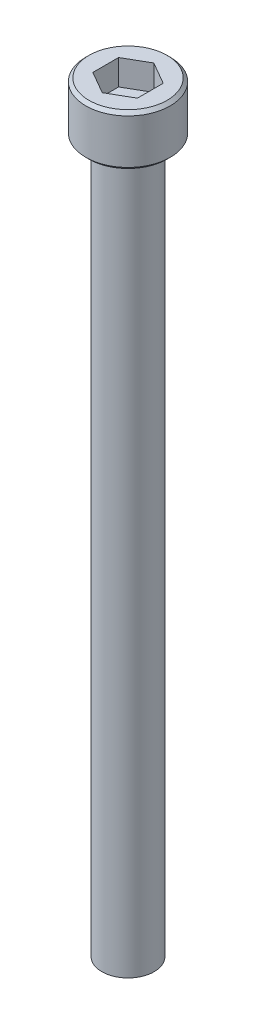
ISO-10303-21;
HEADER;
FILE_DESCRIPTION(('STEP AP214'),'2;1');
FILE_NAME('part.step','',(''),(''),'','','');
FILE_SCHEMA(('AUTOMOTIVE_DESIGN { 1 0 10303 214 1 1 1 1 }'));
ENDSEC;
DATA;
#1=APPLICATION_CONTEXT('core data for automotive mechanical design processes');
#2=APPLICATION_PROTOCOL_DEFINITION('international standard','automotive_design',2000,#1);
#3=PRODUCT_CONTEXT('',#1,'mechanical');
#4=PRODUCT('Part','Part','',(#3));
#5=PRODUCT_RELATED_PRODUCT_CATEGORY('part','',(#4));
#6=PRODUCT_DEFINITION_FORMATION('','',#4);
#7=PRODUCT_DEFINITION_CONTEXT('part definition',#1,'design');
#8=PRODUCT_DEFINITION('design','',#6,#7);
#9=PRODUCT_DEFINITION_SHAPE('','',#8);
#10=(LENGTH_UNIT() NAMED_UNIT(*) SI_UNIT(.MILLI.,.METRE.));
#11=(NAMED_UNIT(*) PLANE_ANGLE_UNIT() SI_UNIT($,.RADIAN.));
#12=(NAMED_UNIT(*) SI_UNIT($,.STERADIAN.) SOLID_ANGLE_UNIT());
#13=UNCERTAINTY_MEASURE_WITH_UNIT(LENGTH_MEASURE(1.E-05),#10,'distance_accuracy_value','');
#14=(GEOMETRIC_REPRESENTATION_CONTEXT(3) GLOBAL_UNCERTAINTY_ASSIGNED_CONTEXT((#13)) GLOBAL_UNIT_ASSIGNED_CONTEXT((#10,
#11,#12)) REPRESENTATION_CONTEXT('',''));
#15=CARTESIAN_POINT('',(0.,0.,0.));
#16=DIRECTION('',(0.,0.,1.));
#17=DIRECTION('',(1.,0.,0.));
#18=AXIS2_PLACEMENT_3D('',#15,#16,#17);
#19=CARTESIAN_POINT('',(1.778,2.032,3.07958633585746));
#20=DIRECTION('',(0.,1.,0.));
#21=DIRECTION('',(0.,0.,1.));
#22=AXIS2_PLACEMENT_3D('',#19,#20,#21);
#23=PLANE('',#22);
#24=DIRECTION('',(-0.866025403784439,0.,0.5));
#25=VECTOR('',#24,1.);
#26=CARTESIAN_POINT('',(0.,2.032,-2.05305755723831));
#27=LINE('',#26,#25);
#28=CARTESIAN_POINT('',(0.,2.032,-2.05305755723831));
#29=VERTEX_POINT('',#28);
#30=CARTESIAN_POINT('',(-1.778,2.032,-1.02652877861915));
#31=VERTEX_POINT('',#30);
#32=EDGE_CURVE('E68',#29,#31,#27,.T.);
#33=ORIENTED_EDGE('',*,*,#32,.T.);
#34=DIRECTION('',(0.,0.,1.));
#35=VECTOR('',#34,1.);
#36=CARTESIAN_POINT('',(-1.778,2.032,-1.02652877861915));
#37=LINE('',#36,#35);
#38=CARTESIAN_POINT('',(-1.778,2.032,1.02652877861915));
#39=VERTEX_POINT('',#38);
#40=EDGE_CURVE('E70',#31,#39,#37,.T.);
#41=ORIENTED_EDGE('',*,*,#40,.T.);
#42=DIRECTION('',(0.866025403784439,0.,0.499999999999999));
#43=VECTOR('',#42,1.);
#44=CARTESIAN_POINT('',(-1.778,2.032,1.02652877861915));
#45=LINE('',#44,#43);
#46=CARTESIAN_POINT('',(0.,2.032,2.05305755723831));
#47=VERTEX_POINT('',#46);
#48=EDGE_CURVE('E72',#39,#47,#45,.T.);
#49=ORIENTED_EDGE('',*,*,#48,.T.);
#50=DIRECTION('',(0.866025403784439,0.,-0.5));
#51=VECTOR('',#50,1.);
#52=CARTESIAN_POINT('',(0.,2.032,2.05305755723831));
#53=LINE('',#52,#51);
#54=CARTESIAN_POINT('',(1.778,2.032,1.02652877861915));
#55=VERTEX_POINT('',#54);
#56=EDGE_CURVE('E127',#47,#55,#53,.T.);
#57=ORIENTED_EDGE('',*,*,#56,.T.);
#58=DIRECTION('',(0.,0.,-1.));
#59=VECTOR('',#58,1.);
#60=CARTESIAN_POINT('',(1.778,2.032,1.02652877861915));
#61=LINE('',#60,#59);
#62=CARTESIAN_POINT('',(1.778,2.032,-1.02652877861915));
#63=VERTEX_POINT('',#62);
#64=EDGE_CURVE('E132',#55,#63,#61,.T.);
#65=ORIENTED_EDGE('',*,*,#64,.T.);
#66=DIRECTION('',(-0.866025403784439,0.,-0.5));
#67=VECTOR('',#66,1.);
#68=CARTESIAN_POINT('',(1.778,2.032,-1.02652877861916));
#69=LINE('',#68,#67);
#70=EDGE_CURVE('E136',#63,#29,#69,.T.);
#71=ORIENTED_EDGE('',*,*,#70,.T.);
#72=EDGE_LOOP('',(#33,#41,#49,#57,#65,#71));
#73=FACE_BOUND('',#72,.T.);
#74=ADVANCED_FACE('F17',(#73),#23,.T.);
#75=CARTESIAN_POINT('',(-1.778,2.032,1.02652877861915));
#76=DIRECTION('',(-0.499999999999999,0.,0.866025403784439));
#77=DIRECTION('',(0.866025403784439,0.,0.499999999999999));
#78=AXIS2_PLACEMENT_3D('',#75,#76,#77);
#79=PLANE('',#78);
#80=DIRECTION('',(0.,1.,0.));
#81=VECTOR('',#80,1.);
#82=CARTESIAN_POINT('',(0.,2.032,2.05305755723831));
#83=LINE('',#82,#81);
#84=CARTESIAN_POINT('',(0.,4.064,2.05305755723831));
#85=VERTEX_POINT('',#84);
#86=EDGE_CURVE('E83',#85,#47,#83,.F.);
#87=ORIENTED_EDGE('',*,*,#86,.T.);
#88=ORIENTED_EDGE('',*,*,#48,.F.);
#89=DIRECTION('',(0.,1.,0.));
#90=VECTOR('',#89,1.);
#91=CARTESIAN_POINT('',(-1.778,2.032,1.02652877861915));
#92=LINE('',#91,#90);
#93=CARTESIAN_POINT('',(-1.778,4.064,1.02652877861915));
#94=VERTEX_POINT('',#93);
#95=EDGE_CURVE('E77',#39,#94,#92,.T.);
#96=ORIENTED_EDGE('',*,*,#95,.T.);
#97=DIRECTION('',(-0.866025403784439,0.,-0.499999999999999));
#98=VECTOR('',#97,1.);
#99=CARTESIAN_POINT('',(0.,4.064,2.05305755723831));
#100=LINE('',#99,#98);
#101=EDGE_CURVE('E124',#85,#94,#100,.T.);
#102=ORIENTED_EDGE('',*,*,#101,.F.);
#103=EDGE_LOOP('',(#87,#88,#96,#102));
#104=FACE_BOUND('',#103,.T.);
#105=ADVANCED_FACE('F80',(#104),#79,.F.);
#106=CARTESIAN_POINT('',(-1.778,2.032,-1.02652877861915));
#107=DIRECTION('',(-1.,0.,0.));
#108=DIRECTION('',(0.,0.,1.));
#109=AXIS2_PLACEMENT_3D('',#106,#107,#108);
#110=PLANE('',#109);
#111=ORIENTED_EDGE('',*,*,#95,.F.);
#112=ORIENTED_EDGE('',*,*,#40,.F.);
#113=DIRECTION('',(0.,1.,0.));
#114=VECTOR('',#113,1.);
#115=CARTESIAN_POINT('',(-1.778,2.032,-1.02652877861915));
#116=LINE('',#115,#114);
#117=CARTESIAN_POINT('',(-1.778,4.064,-1.02652877861915));
#118=VERTEX_POINT('',#117);
#119=EDGE_CURVE('E91',#31,#118,#116,.T.);
#120=ORIENTED_EDGE('',*,*,#119,.T.);
#121=DIRECTION('',(0.,0.,1.));
#122=VECTOR('',#121,1.);
#123=CARTESIAN_POINT('',(-1.778,4.064,0.));
#124=LINE('',#123,#122);
#125=EDGE_CURVE('E88',#94,#118,#124,.F.);
#126=ORIENTED_EDGE('',*,*,#125,.F.);
#127=EDGE_LOOP('',(#111,#112,#120,#126));
#128=FACE_BOUND('',#127,.T.);
#129=ADVANCED_FACE('F86',(#128),#110,.F.);
#130=CARTESIAN_POINT('',(0.,2.032,-2.05305755723831));
#131=DIRECTION('',(-0.5,0.,-0.866025403784439));
#132=DIRECTION('',(-0.866025403784439,0.,0.5));
#133=AXIS2_PLACEMENT_3D('',#130,#131,#132);
#134=PLANE('',#133);
#135=ORIENTED_EDGE('',*,*,#119,.F.);
#136=ORIENTED_EDGE('',*,*,#32,.F.);
#137=DIRECTION('',(0.,1.,0.));
#138=VECTOR('',#137,1.);
#139=CARTESIAN_POINT('',(0.,2.032,-2.05305755723831));
#140=LINE('',#139,#138);
#141=CARTESIAN_POINT('',(0.,4.064,-2.05305755723831));
#142=VERTEX_POINT('',#141);
#143=EDGE_CURVE('E134',#29,#142,#140,.T.);
#144=ORIENTED_EDGE('',*,*,#143,.T.);
#145=DIRECTION('',(0.866025403784438,0.,-0.5));
#146=VECTOR('',#145,1.);
#147=CARTESIAN_POINT('',(-1.778,4.064,-1.02652877861915));
#148=LINE('',#147,#146);
#149=EDGE_CURVE('E120',#118,#142,#148,.T.);
#150=ORIENTED_EDGE('',*,*,#149,.F.);
#151=EDGE_LOOP('',(#135,#136,#144,#150));
#152=FACE_BOUND('',#151,.T.);
#153=ADVANCED_FACE('F139',(#152),#134,.F.);
#154=CARTESIAN_POINT('',(1.778,2.032,-1.02652877861916));
#155=DIRECTION('',(0.5,0.,-0.866025403784439));
#156=DIRECTION('',(-0.866025403784439,0.,-0.5));
#157=AXIS2_PLACEMENT_3D('',#154,#155,#156);
#158=PLANE('',#157);
#159=ORIENTED_EDGE('',*,*,#143,.F.);
#160=ORIENTED_EDGE('',*,*,#70,.F.);
#161=DIRECTION('',(0.,1.,0.));
#162=VECTOR('',#161,1.);
#163=CARTESIAN_POINT('',(1.778,2.032,-1.02652877861916));
#164=LINE('',#163,#162);
#165=CARTESIAN_POINT('',(1.778,4.064,-1.02652877861916));
#166=VERTEX_POINT('',#165);
#167=EDGE_CURVE('E130',#63,#166,#164,.T.);
#168=ORIENTED_EDGE('',*,*,#167,.T.);
#169=DIRECTION('',(0.866025403784439,0.,0.5));
#170=VECTOR('',#169,1.);
#171=CARTESIAN_POINT('',(0.,4.064,-2.05305755723831));
#172=LINE('',#171,#170);
#173=EDGE_CURVE('E117',#142,#166,#172,.T.);
#174=ORIENTED_EDGE('',*,*,#173,.F.);
#175=EDGE_LOOP('',(#159,#160,#168,#174));
#176=FACE_BOUND('',#175,.T.);
#177=ADVANCED_FACE('F151',(#176),#158,.F.);
#178=CARTESIAN_POINT('',(1.778,2.032,1.02652877861915));
#179=DIRECTION('',(1.,0.,0.));
#180=DIRECTION('',(0.,0.,-1.));
#181=AXIS2_PLACEMENT_3D('',#178,#179,#180);
#182=PLANE('',#181);
#183=ORIENTED_EDGE('',*,*,#167,.F.);
#184=ORIENTED_EDGE('',*,*,#64,.F.);
#185=DIRECTION('',(0.,1.,0.));
#186=VECTOR('',#185,1.);
#187=CARTESIAN_POINT('',(1.778,2.032,1.02652877861915));
#188=LINE('',#187,#186);
#189=CARTESIAN_POINT('',(1.778,4.064,1.02652877861915));
#190=VERTEX_POINT('',#189);
#191=EDGE_CURVE('E35',#55,#190,#188,.T.);
#192=ORIENTED_EDGE('',*,*,#191,.T.);
#193=DIRECTION('',(0.,0.,1.));
#194=VECTOR('',#193,1.);
#195=CARTESIAN_POINT('',(1.778,4.064,0.));
#196=LINE('',#195,#194);
#197=EDGE_CURVE('E114',#166,#190,#196,.T.);
#198=ORIENTED_EDGE('',*,*,#197,.F.);
#199=EDGE_LOOP('',(#183,#184,#192,#198));
#200=FACE_BOUND('',#199,.T.);
#201=ADVANCED_FACE('F149',(#200),#182,.F.);
#202=CARTESIAN_POINT('',(0.,2.032,2.05305755723831));
#203=DIRECTION('',(0.5,0.,0.866025403784439));
#204=DIRECTION('',(0.866025403784439,0.,-0.5));
#205=AXIS2_PLACEMENT_3D('',#202,#203,#204);
#206=PLANE('',#205);
#207=ORIENTED_EDGE('',*,*,#191,.F.);
#208=ORIENTED_EDGE('',*,*,#56,.F.);
#209=ORIENTED_EDGE('',*,*,#86,.F.);
#210=DIRECTION('',(-0.866025403784438,0.,0.5));
#211=VECTOR('',#210,1.);
#212=CARTESIAN_POINT('',(1.778,4.064,1.02652877861915));
#213=LINE('',#212,#211);
#214=EDGE_CURVE('E111',#190,#85,#213,.T.);
#215=ORIENTED_EDGE('',*,*,#214,.F.);
#216=EDGE_LOOP('',(#207,#208,#209,#215));
#217=FACE_BOUND('',#216,.T.);
#218=ADVANCED_FACE('F146',(#217),#206,.F.);
#219=CARTESIAN_POINT('',(0.,4.064,0.));
#220=DIRECTION('',(0.,1.,0.));
#221=DIRECTION('',(0.,0.,1.));
#222=AXIS2_PLACEMENT_3D('',#219,#220,#221);
#223=PLANE('',#222);
#224=ORIENTED_EDGE('',*,*,#197,.T.);
#225=ORIENTED_EDGE('',*,*,#214,.T.);
#226=ORIENTED_EDGE('',*,*,#101,.T.);
#227=ORIENTED_EDGE('',*,*,#125,.T.);
#228=ORIENTED_EDGE('',*,*,#149,.T.);
#229=ORIENTED_EDGE('',*,*,#173,.T.);
#230=EDGE_LOOP('',(#224,#225,#226,#227,#228,#229));
#231=FACE_BOUND('',#230,.T.);
#232=CARTESIAN_POINT('',(0.,4.0639999999712,0.));
#233=DIRECTION('',(0.,-1.,0.));
#234=DIRECTION('',(0.,0.,-1.));
#235=AXIS2_PLACEMENT_3D('',#232,#233,#234);
#236=CIRCLE('',#235,3.11149999998861);
#237=CARTESIAN_POINT('',(0.,4.0639999999712,-3.11149999998861));
#238=VERTEX_POINT('',#237);
#239=EDGE_CURVE('E20',#238,#238,#236,.T.);
#240=ORIENTED_EDGE('',*,*,#239,.F.);
#241=EDGE_LOOP('',(#240));
#242=FACE_BOUND('',#241,.T.);
#243=ADVANCED_FACE('F143',(#231,#242),#223,.T.);
#244=CARTESIAN_POINT('',(0.,3.80999999998721,0.));
#245=DIRECTION('',(0.,-1.,0.));
#246=DIRECTION('',(0.,0.,-1.));
#247=AXIS2_PLACEMENT_3D('',#244,#245,#246);
#248=CONICAL_SURFACE('',#247,3.3654999999726,0.785398163397448);
#249=ORIENTED_EDGE('',*,*,#239,.T.);
#250=EDGE_LOOP('',(#249));
#251=FACE_BOUND('',#250,.T.);
#252=CARTESIAN_POINT('',(0.,3.81,0.));
#253=DIRECTION('',(0.,-1.,0.));
#254=DIRECTION('',(0.,0.,-1.));
#255=AXIS2_PLACEMENT_3D('',#252,#253,#254);
#256=CIRCLE('',#255,3.3655);
#257=CARTESIAN_POINT('',(0.,3.81,-3.3655));
#258=VERTEX_POINT('',#257);
#259=EDGE_CURVE('E103',#258,#258,#256,.T.);
#260=ORIENTED_EDGE('',*,*,#259,.F.);
#261=EDGE_LOOP('',(#260));
#262=FACE_BOUND('',#261,.T.);
#263=ADVANCED_FACE('F188',(#251,#262),#248,.T.);
#264=CARTESIAN_POINT('',(0.,4.064,0.));
#265=DIRECTION('',(0.,-1.,0.));
#266=DIRECTION('',(0.,0.,-1.));
#267=AXIS2_PLACEMENT_3D('',#264,#265,#266);
#268=CYLINDRICAL_SURFACE('',#267,3.3655);
#269=ORIENTED_EDGE('',*,*,#259,.T.);
#270=EDGE_LOOP('',(#269));
#271=FACE_BOUND('',#270,.T.);
#272=CARTESIAN_POINT('',(0.,0.254000000040833,0.));
#273=DIRECTION('',(0.,1.,0.));
#274=DIRECTION('',(0.,0.,1.));
#275=AXIS2_PLACEMENT_3D('',#272,#273,#274);
#276=CIRCLE('',#275,3.3654999999726);
#277=CARTESIAN_POINT('',(0.,0.254000000040833,3.3654999999726));
#278=VERTEX_POINT('',#277);
#279=EDGE_CURVE('E99',#278,#278,#276,.F.);
#280=ORIENTED_EDGE('',*,*,#279,.F.);
#281=EDGE_LOOP('',(#280));
#282=FACE_BOUND('',#281,.T.);
#283=ADVANCED_FACE('F184',(#271,#282),#268,.T.);
#284=CARTESIAN_POINT('',(0.,-57.15,0.));
#285=DIRECTION('',(0.,1.,0.));
#286=DIRECTION('',(0.,0.,1.));
#287=AXIS2_PLACEMENT_3D('',#284,#285,#286);
#288=PLANE('',#287);
#289=CARTESIAN_POINT('',(0.,-57.1499999999617,0.));
#290=DIRECTION('',(0.,1.,0.));
#291=DIRECTION('',(0.,0.,1.));
#292=AXIS2_PLACEMENT_3D('',#289,#290,#291);
#293=CIRCLE('',#292,1.31318000001102);
#294=CARTESIAN_POINT('',(0.,-57.1499999999617,1.31318000001102));
#295=VERTEX_POINT('',#294);
#296=EDGE_CURVE('E97',#295,#295,#293,.T.);
#297=ORIENTED_EDGE('',*,*,#296,.F.);
#298=EDGE_LOOP('',(#297));
#299=FACE_BOUND('',#298,.T.);
#300=ADVANCED_FACE('F180',(#299),#288,.F.);
#301=CARTESIAN_POINT('',(0.,0.254000000040833,0.));
#302=DIRECTION('',(0.,1.,0.));
#303=DIRECTION('',(0.,0.,1.));
#304=AXIS2_PLACEMENT_3D('',#301,#302,#303);
#305=CONICAL_SURFACE('',#304,3.3654999999726,0.785398163397448);
#306=CARTESIAN_POINT('',(0.,5.6843418860808E-11,0.));
#307=DIRECTION('',(0.,1.,0.));
#308=DIRECTION('',(0.,0.,1.));
#309=AXIS2_PLACEMENT_3D('',#306,#307,#308);
#310=CIRCLE('',#309,3.11149999998861);
#311=CARTESIAN_POINT('',(0.,5.6843418860808E-11,3.11149999998861));
#312=VERTEX_POINT('',#311);
#313=EDGE_CURVE('E95',#312,#312,#310,.T.);
#314=ORIENTED_EDGE('',*,*,#313,.T.);
#315=EDGE_LOOP('',(#314));
#316=FACE_BOUND('',#315,.T.);
#317=ORIENTED_EDGE('',*,*,#279,.T.);
#318=EDGE_LOOP('',(#317));
#319=FACE_BOUND('',#318,.T.);
#320=ADVANCED_FACE('F176',(#316,#319),#305,.T.);
#321=CARTESIAN_POINT('',(0.,-56.6115199999899,0.));
#322=DIRECTION('',(0.,1.,0.));
#323=DIRECTION('',(0.,0.,1.));
#324=AXIS2_PLACEMENT_3D('',#321,#322,#323);
#325=CONICAL_SURFACE('',#324,2.0827999999824,0.960291895417683);
#326=CARTESIAN_POINT('',(0.,-56.61152,0.));
#327=DIRECTION('',(0.,1.,0.));
#328=DIRECTION('',(0.,0.,1.));
#329=AXIS2_PLACEMENT_3D('',#326,#327,#328);
#330=CIRCLE('',#329,2.0828);
#331=CARTESIAN_POINT('',(0.,-56.61152,2.0828));
#332=VERTEX_POINT('',#331);
#333=EDGE_CURVE('E26',#332,#332,#330,.T.);
#334=ORIENTED_EDGE('',*,*,#333,.F.);
#335=EDGE_LOOP('',(#334));
#336=FACE_BOUND('',#335,.T.);
#337=ORIENTED_EDGE('',*,*,#296,.T.);
#338=EDGE_LOOP('',(#337));
#339=FACE_BOUND('',#338,.T.);
#340=ADVANCED_FACE('F169',(#336,#339),#325,.T.);
#341=CARTESIAN_POINT('',(0.,0.,0.));
#342=DIRECTION('',(0.,1.,0.));
#343=DIRECTION('',(0.,0.,1.));
#344=AXIS2_PLACEMENT_3D('',#341,#342,#343);
#345=PLANE('',#344);
#346=CARTESIAN_POINT('',(0.,0.,0.));
#347=DIRECTION('',(0.,1.,0.));
#348=DIRECTION('',(0.,0.,1.));
#349=AXIS2_PLACEMENT_3D('',#346,#347,#348);
#350=CIRCLE('',#349,2.0828);
#351=CARTESIAN_POINT('',(0.,0.,2.0828));
#352=VERTEX_POINT('',#351);
#353=EDGE_CURVE('E11',#352,#352,#350,.F.);
#354=ORIENTED_EDGE('',*,*,#353,.F.);
#355=EDGE_LOOP('',(#354));
#356=FACE_BOUND('',#355,.T.);
#357=ORIENTED_EDGE('',*,*,#313,.F.);
#358=EDGE_LOOP('',(#357));
#359=FACE_BOUND('',#358,.T.);
#360=ADVANCED_FACE('F163',(#356,#359),#345,.F.);
#361=CARTESIAN_POINT('',(0.,-57.15,0.));
#362=DIRECTION('',(0.,1.,0.));
#363=DIRECTION('',(0.,0.,1.));
#364=AXIS2_PLACEMENT_3D('',#361,#362,#363);
#365=CYLINDRICAL_SURFACE('',#364,2.0828);
#366=ORIENTED_EDGE('',*,*,#353,.T.);
#367=EDGE_LOOP('',(#366));
#368=FACE_BOUND('',#367,.T.);
#369=ORIENTED_EDGE('',*,*,#333,.T.);
#370=EDGE_LOOP('',(#369));
#371=FACE_BOUND('',#370,.T.);
#372=ADVANCED_FACE('F161',(#368,#371),#365,.T.);
#373=CLOSED_SHELL('',(#74,#105,#129,#153,#177,#201,#218,#243,#263,#283,#300,#320,#340,#360,#372));
#374=MANIFOLD_SOLID_BREP('B1',#373);
#375=ADVANCED_BREP_SHAPE_REPRESENTATION('',(#18,#374),#14);
#376=SHAPE_DEFINITION_REPRESENTATION(#9,#375);
ENDSEC;
END-ISO-10303-21;
